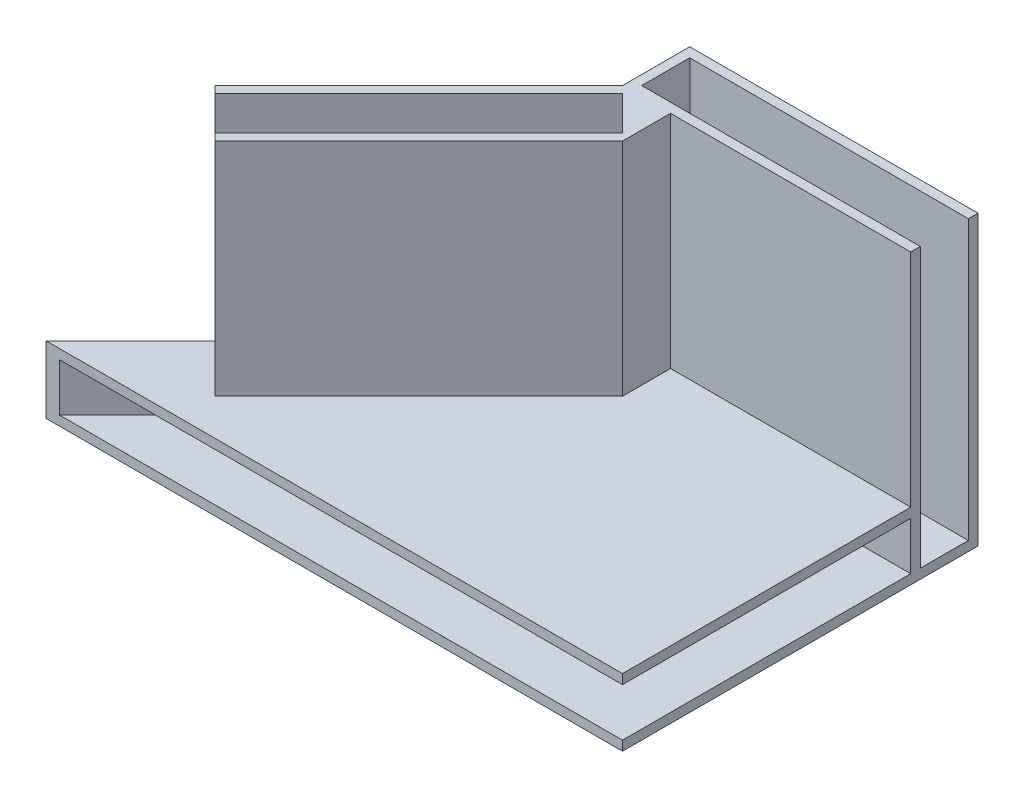
ISO-10303-21;
HEADER;
FILE_DESCRIPTION(('STEP AP214'),'2;1');
FILE_NAME('part.step','',(''),(''),'','','');
FILE_SCHEMA(('AUTOMOTIVE_DESIGN { 1 0 10303 214 1 1 1 1 }'));
ENDSEC;
DATA;
#1=APPLICATION_CONTEXT('core data for automotive mechanical design processes');
#2=APPLICATION_PROTOCOL_DEFINITION('international standard','automotive_design',2000,#1);
#3=PRODUCT_CONTEXT('',#1,'mechanical');
#4=PRODUCT('Part','Part','',(#3));
#5=PRODUCT_RELATED_PRODUCT_CATEGORY('part','',(#4));
#6=PRODUCT_DEFINITION_FORMATION('','',#4);
#7=PRODUCT_DEFINITION_CONTEXT('part definition',#1,'design');
#8=PRODUCT_DEFINITION('design','',#6,#7);
#9=PRODUCT_DEFINITION_SHAPE('','',#8);
#10=(LENGTH_UNIT() NAMED_UNIT(*) SI_UNIT(.MILLI.,.METRE.));
#11=(NAMED_UNIT(*) PLANE_ANGLE_UNIT() SI_UNIT($,.RADIAN.));
#12=(NAMED_UNIT(*) SI_UNIT($,.STERADIAN.) SOLID_ANGLE_UNIT());
#13=UNCERTAINTY_MEASURE_WITH_UNIT(LENGTH_MEASURE(1.E-05),#10,'distance_accuracy_value','');
#14=(GEOMETRIC_REPRESENTATION_CONTEXT(3) GLOBAL_UNCERTAINTY_ASSIGNED_CONTEXT((#13)) GLOBAL_UNIT_ASSIGNED_CONTEXT((#10,
#11,#12)) REPRESENTATION_CONTEXT('',''));
#15=CARTESIAN_POINT('',(0.,0.,0.));
#16=DIRECTION('',(0.,0.,1.));
#17=DIRECTION('',(1.,0.,0.));
#18=AXIS2_PLACEMENT_3D('',#15,#16,#17);
#19=CARTESIAN_POINT('',(0.,0.,7.));
#20=DIRECTION('',(0.,0.,-1.));
#21=DIRECTION('',(-1.,0.,0.));
#22=AXIS2_PLACEMENT_3D('',#19,#20,#21);
#23=PLANE('',#22);
#24=DIRECTION('',(1.,0.,0.));
#25=VECTOR('',#24,1.);
#26=CARTESIAN_POINT('',(0.,0.,7.));
#27=LINE('',#26,#25);
#28=CARTESIAN_POINT('',(5.,0.,7.));
#29=VERTEX_POINT('',#28);
#30=CARTESIAN_POINT('',(30.,0.,7.));
#31=VERTEX_POINT('',#30);
#32=EDGE_CURVE('E285',#29,#31,#27,.T.);
#33=ORIENTED_EDGE('',*,*,#32,.F.);
#34=DIRECTION('',(0.,1.,0.));
#35=VECTOR('',#34,1.);
#36=CARTESIAN_POINT('',(5.,0.,7.));
#37=LINE('',#36,#35);
#38=CARTESIAN_POINT('',(5.,-23.,7.));
#39=VERTEX_POINT('',#38);
#40=EDGE_CURVE('E218',#39,#29,#37,.T.);
#41=ORIENTED_EDGE('',*,*,#40,.F.);
#42=DIRECTION('',(1.,0.,0.));
#43=VECTOR('',#42,1.);
#44=CARTESIAN_POINT('',(0.,-23.,7.));
#45=LINE('',#44,#43);
#46=CARTESIAN_POINT('',(30.,-23.,7.));
#47=VERTEX_POINT('',#46);
#48=EDGE_CURVE('E283',#39,#47,#45,.T.);
#49=ORIENTED_EDGE('',*,*,#48,.T.);
#50=DIRECTION('',(0.,1.,0.));
#51=VECTOR('',#50,1.);
#52=CARTESIAN_POINT('',(30.,0.,7.));
#53=LINE('',#52,#51);
#54=EDGE_CURVE('E44',#47,#31,#53,.T.);
#55=ORIENTED_EDGE('',*,*,#54,.T.);
#56=EDGE_LOOP('',(#33,#41,#49,#55));
#57=FACE_BOUND('',#56,.T.);
#58=ADVANCED_FACE('F36',(#57),#23,.F.);
#59=CARTESIAN_POINT('',(0.,0.,7.));
#60=DIRECTION('',(1.,0.,0.));
#61=DIRECTION('',(0.,0.,-1.));
#62=AXIS2_PLACEMENT_3D('',#59,#60,#61);
#63=PLANE('',#62);
#64=DIRECTION('',(0.,0.,-1.));
#65=VECTOR('',#64,1.);
#66=CARTESIAN_POINT('',(0.,0.,7.));
#67=LINE('',#66,#65);
#68=CARTESIAN_POINT('',(0.,0.,7.));
#69=VERTEX_POINT('',#68);
#70=CARTESIAN_POINT('',(0.,0.,0.));
#71=VERTEX_POINT('',#70);
#72=EDGE_CURVE('E190',#69,#71,#67,.T.);
#73=ORIENTED_EDGE('',*,*,#72,.T.);
#74=DIRECTION('',(0.,-1.,0.));
#75=VECTOR('',#74,1.);
#76=CARTESIAN_POINT('',(0.,0.,0.));
#77=LINE('',#76,#75);
#78=CARTESIAN_POINT('',(0.,-30.,0.));
#79=VERTEX_POINT('',#78);
#80=EDGE_CURVE('E229',#71,#79,#77,.T.);
#81=ORIENTED_EDGE('',*,*,#80,.T.);
#82=DIRECTION('',(0.,0.,-1.));
#83=VECTOR('',#82,1.);
#84=CARTESIAN_POINT('',(0.,-30.,7.));
#85=LINE('',#84,#83);
#86=CARTESIAN_POINT('',(0.,-30.,7.));
#87=VERTEX_POINT('',#86);
#88=EDGE_CURVE('E211',#87,#79,#85,.T.);
#89=ORIENTED_EDGE('',*,*,#88,.F.);
#90=DIRECTION('',(0.,-1.,0.));
#91=VECTOR('',#90,1.);
#92=CARTESIAN_POINT('',(0.,23.,7.));
#93=LINE('',#92,#91);
#94=EDGE_CURVE('E204',#69,#87,#93,.T.);
#95=ORIENTED_EDGE('',*,*,#94,.F.);
#96=EDGE_LOOP('',(#73,#81,#89,#95));
#97=FACE_BOUND('',#96,.T.);
#98=ADVANCED_FACE('F38',(#97),#63,.F.);
#99=CARTESIAN_POINT('',(30.,0.,7.));
#100=DIRECTION('',(-1.,0.,0.));
#101=DIRECTION('',(0.,0.,1.));
#102=AXIS2_PLACEMENT_3D('',#99,#100,#101);
#103=PLANE('',#102);
#104=DIRECTION('',(0.,0.,1.));
#105=VECTOR('',#104,1.);
#106=CARTESIAN_POINT('',(30.,0.,0.));
#107=LINE('',#106,#105);
#108=CARTESIAN_POINT('',(30.,0.,6.));
#109=VERTEX_POINT('',#108);
#110=EDGE_CURVE('E393',#109,#31,#107,.T.);
#111=ORIENTED_EDGE('',*,*,#110,.T.);
#112=ORIENTED_EDGE('',*,*,#54,.F.);
#113=DIRECTION('',(0.,0.,-1.));
#114=VECTOR('',#113,1.);
#115=CARTESIAN_POINT('',(30.,-23.,37.));
#116=LINE('',#115,#114);
#117=CARTESIAN_POINT('',(30.,-23.,37.));
#118=VERTEX_POINT('',#117);
#119=EDGE_CURVE('E369',#118,#47,#116,.T.);
#120=ORIENTED_EDGE('',*,*,#119,.F.);
#121=DIRECTION('',(0.,-1.,0.));
#122=VECTOR('',#121,1.);
#123=CARTESIAN_POINT('',(30.,-30.,37.));
#124=LINE('',#123,#122);
#125=CARTESIAN_POINT('',(30.,-24.,37.));
#126=VERTEX_POINT('',#125);
#127=EDGE_CURVE('E364',#118,#126,#124,.T.);
#128=ORIENTED_EDGE('',*,*,#127,.T.);
#129=DIRECTION('',(0.,0.,-1.));
#130=VECTOR('',#129,1.);
#131=CARTESIAN_POINT('',(30.,-24.,36.));
#132=LINE('',#131,#130);
#133=CARTESIAN_POINT('',(30.,-24.,7.));
#134=VERTEX_POINT('',#133);
#135=EDGE_CURVE('E299',#126,#134,#132,.T.);
#136=ORIENTED_EDGE('',*,*,#135,.T.);
#137=DIRECTION('',(0.,-1.,0.));
#138=VECTOR('',#137,1.);
#139=CARTESIAN_POINT('',(30.,-24.,7.));
#140=LINE('',#139,#138);
#141=CARTESIAN_POINT('',(30.,-29.,7.));
#142=VERTEX_POINT('',#141);
#143=EDGE_CURVE('E301',#134,#142,#140,.T.);
#144=ORIENTED_EDGE('',*,*,#143,.T.);
#145=DIRECTION('',(0.,0.,1.));
#146=VECTOR('',#145,1.);
#147=CARTESIAN_POINT('',(30.,-29.,36.));
#148=LINE('',#147,#146);
#149=CARTESIAN_POINT('',(30.,-29.,37.));
#150=VERTEX_POINT('',#149);
#151=EDGE_CURVE('E304',#142,#150,#148,.T.);
#152=ORIENTED_EDGE('',*,*,#151,.T.);
#153=CARTESIAN_POINT('',(30.,-30.,37.));
#154=VERTEX_POINT('',#153);
#155=EDGE_CURVE('E363',#150,#154,#124,.T.);
#156=ORIENTED_EDGE('',*,*,#155,.T.);
#157=DIRECTION('',(0.,0.,-1.));
#158=VECTOR('',#157,1.);
#159=CARTESIAN_POINT('',(30.,-30.,7.));
#160=LINE('',#159,#158);
#161=CARTESIAN_POINT('',(30.,-30.,0.));
#162=VERTEX_POINT('',#161);
#163=EDGE_CURVE('E242',#154,#162,#160,.T.);
#164=ORIENTED_EDGE('',*,*,#163,.T.);
#165=DIRECTION('',(0.,1.,0.));
#166=VECTOR('',#165,1.);
#167=CARTESIAN_POINT('',(30.,0.,0.));
#168=LINE('',#167,#166);
#169=CARTESIAN_POINT('',(30.,0.,0.));
#170=VERTEX_POINT('',#169);
#171=EDGE_CURVE('E232',#162,#170,#168,.T.);
#172=ORIENTED_EDGE('',*,*,#171,.T.);
#173=CARTESIAN_POINT('',(30.,0.,1.));
#174=VERTEX_POINT('',#173);
#175=EDGE_CURVE('E239',#170,#174,#107,.T.);
#176=ORIENTED_EDGE('',*,*,#175,.T.);
#177=DIRECTION('',(0.,1.,0.));
#178=VECTOR('',#177,1.);
#179=CARTESIAN_POINT('',(30.,0.,1.));
#180=LINE('',#179,#178);
#181=CARTESIAN_POINT('',(30.,-29.,1.));
#182=VERTEX_POINT('',#181);
#183=EDGE_CURVE('E215',#182,#174,#180,.T.);
#184=ORIENTED_EDGE('',*,*,#183,.F.);
#185=DIRECTION('',(0.,0.,-1.));
#186=VECTOR('',#185,1.);
#187=CARTESIAN_POINT('',(30.,-29.,7.));
#188=LINE('',#187,#186);
#189=CARTESIAN_POINT('',(30.,-29.,6.));
#190=VERTEX_POINT('',#189);
#191=EDGE_CURVE('E251',#190,#182,#188,.T.);
#192=ORIENTED_EDGE('',*,*,#191,.F.);
#193=DIRECTION('',(0.,1.,0.));
#194=VECTOR('',#193,1.);
#195=CARTESIAN_POINT('',(30.,0.,6.));
#196=LINE('',#195,#194);
#197=EDGE_CURVE('E224',#190,#109,#196,.T.);
#198=ORIENTED_EDGE('',*,*,#197,.T.);
#199=EDGE_LOOP('',(#111,#112,#120,#128,#136,#144,#152,#156,#164,#172,#176,#184,#192,#198));
#200=FACE_BOUND('',#199,.T.);
#201=ADVANCED_FACE('F238',(#200),#103,.F.);
#202=CARTESIAN_POINT('',(0.,0.,0.));
#203=DIRECTION('',(0.,0.,-1.));
#204=DIRECTION('',(-1.,0.,0.));
#205=AXIS2_PLACEMENT_3D('',#202,#203,#204);
#206=PLANE('',#205);
#207=ORIENTED_EDGE('',*,*,#80,.F.);
#208=DIRECTION('',(1.,0.,0.));
#209=VECTOR('',#208,1.);
#210=CARTESIAN_POINT('',(0.,0.,0.));
#211=LINE('',#210,#209);
#212=EDGE_CURVE('E195',#71,#170,#211,.T.);
#213=ORIENTED_EDGE('',*,*,#212,.T.);
#214=ORIENTED_EDGE('',*,*,#171,.F.);
#215=DIRECTION('',(-1.,0.,0.));
#216=VECTOR('',#215,1.);
#217=CARTESIAN_POINT('',(0.,-30.,0.));
#218=LINE('',#217,#216);
#219=EDGE_CURVE('E247',#162,#79,#218,.T.);
#220=ORIENTED_EDGE('',*,*,#219,.T.);
#221=EDGE_LOOP('',(#207,#213,#214,#220));
#222=FACE_BOUND('',#221,.T.);
#223=ADVANCED_FACE('F246',(#222),#206,.T.);
#224=CARTESIAN_POINT('',(1.,0.,7.));
#225=DIRECTION('',(1.,0.,0.));
#226=DIRECTION('',(0.,0.,-1.));
#227=AXIS2_PLACEMENT_3D('',#224,#225,#226);
#228=PLANE('',#227);
#229=DIRECTION('',(0.,-1.,0.));
#230=VECTOR('',#229,1.);
#231=CARTESIAN_POINT('',(1.,0.,1.));
#232=LINE('',#231,#230);
#233=CARTESIAN_POINT('',(1.,0.,1.));
#234=VERTEX_POINT('',#233);
#235=CARTESIAN_POINT('',(1.,-29.,1.));
#236=VERTEX_POINT('',#235);
#237=EDGE_CURVE('E212',#234,#236,#232,.T.);
#238=ORIENTED_EDGE('',*,*,#237,.F.);
#239=DIRECTION('',(0.,0.,1.));
#240=VECTOR('',#239,1.);
#241=CARTESIAN_POINT('',(1.,0.,7.));
#242=LINE('',#241,#240);
#243=CARTESIAN_POINT('',(1.,0.,6.));
#244=VERTEX_POINT('',#243);
#245=EDGE_CURVE('E288',#234,#244,#242,.T.);
#246=ORIENTED_EDGE('',*,*,#245,.T.);
#247=DIRECTION('',(0.,-1.,0.));
#248=VECTOR('',#247,1.);
#249=CARTESIAN_POINT('',(1.,0.,6.));
#250=LINE('',#249,#248);
#251=CARTESIAN_POINT('',(1.,-29.,6.));
#252=VERTEX_POINT('',#251);
#253=EDGE_CURVE('E222',#244,#252,#250,.T.);
#254=ORIENTED_EDGE('',*,*,#253,.T.);
#255=DIRECTION('',(0.,0.,-1.));
#256=VECTOR('',#255,1.);
#257=CARTESIAN_POINT('',(1.,-29.,7.));
#258=LINE('',#257,#256);
#259=EDGE_CURVE('E255',#252,#236,#258,.T.);
#260=ORIENTED_EDGE('',*,*,#259,.T.);
#261=EDGE_LOOP('',(#238,#246,#254,#260));
#262=FACE_BOUND('',#261,.T.);
#263=ADVANCED_FACE('F389',(#262),#228,.T.);
#264=CARTESIAN_POINT('',(0.,0.,6.));
#265=DIRECTION('',(0.,0.,-1.));
#266=DIRECTION('',(-1.,0.,0.));
#267=AXIS2_PLACEMENT_3D('',#264,#265,#266);
#268=PLANE('',#267);
#269=ORIENTED_EDGE('',*,*,#253,.F.);
#270=DIRECTION('',(1.,0.,0.));
#271=VECTOR('',#270,1.);
#272=CARTESIAN_POINT('',(0.,0.,6.));
#273=LINE('',#272,#271);
#274=EDGE_CURVE('E296',#244,#109,#273,.T.);
#275=ORIENTED_EDGE('',*,*,#274,.T.);
#276=ORIENTED_EDGE('',*,*,#197,.F.);
#277=DIRECTION('',(-1.,0.,0.));
#278=VECTOR('',#277,1.);
#279=CARTESIAN_POINT('',(0.,-29.,6.));
#280=LINE('',#279,#278);
#281=EDGE_CURVE('E375',#190,#252,#280,.T.);
#282=ORIENTED_EDGE('',*,*,#281,.T.);
#283=EDGE_LOOP('',(#269,#275,#276,#282));
#284=FACE_BOUND('',#283,.T.);
#285=ADVANCED_FACE('F382',(#284),#268,.T.);
#286=CARTESIAN_POINT('',(0.,0.,1.));
#287=DIRECTION('',(0.,0.,-1.));
#288=DIRECTION('',(-1.,0.,0.));
#289=AXIS2_PLACEMENT_3D('',#286,#287,#288);
#290=PLANE('',#289);
#291=DIRECTION('',(1.,0.,0.));
#292=VECTOR('',#291,1.);
#293=CARTESIAN_POINT('',(0.,0.,1.));
#294=LINE('',#293,#292);
#295=EDGE_CURVE('E286',#234,#174,#294,.T.);
#296=ORIENTED_EDGE('',*,*,#295,.F.);
#297=ORIENTED_EDGE('',*,*,#237,.T.);
#298=DIRECTION('',(-1.,0.,0.));
#299=VECTOR('',#298,1.);
#300=CARTESIAN_POINT('',(0.,-29.,1.));
#301=LINE('',#300,#299);
#302=EDGE_CURVE('E372',#182,#236,#301,.T.);
#303=ORIENTED_EDGE('',*,*,#302,.F.);
#304=ORIENTED_EDGE('',*,*,#183,.T.);
#305=EDGE_LOOP('',(#296,#297,#303,#304));
#306=FACE_BOUND('',#305,.T.);
#307=ADVANCED_FACE('F392',(#306),#290,.F.);
#308=CARTESIAN_POINT('',(5.,0.,12.));
#309=DIRECTION('',(-1.,0.,0.));
#310=DIRECTION('',(0.,0.,1.));
#311=AXIS2_PLACEMENT_3D('',#308,#309,#310);
#312=PLANE('',#311);
#313=DIRECTION('',(0.,0.,-1.));
#314=VECTOR('',#313,1.);
#315=CARTESIAN_POINT('',(5.,0.,12.));
#316=LINE('',#315,#314);
#317=CARTESIAN_POINT('',(4.99999999999999,0.,12.));
#318=VERTEX_POINT('',#317);
#319=EDGE_CURVE('E276',#318,#29,#316,.T.);
#320=ORIENTED_EDGE('',*,*,#319,.F.);
#321=DIRECTION('',(0.,1.,0.));
#322=VECTOR('',#321,1.);
#323=CARTESIAN_POINT('',(5.,0.,12.));
#324=LINE('',#323,#322);
#325=CARTESIAN_POINT('',(5.,-23.,12.));
#326=VERTEX_POINT('',#325);
#327=EDGE_CURVE('E213',#326,#318,#324,.T.);
#328=ORIENTED_EDGE('',*,*,#327,.F.);
#329=DIRECTION('',(0.,0.,-1.));
#330=VECTOR('',#329,1.);
#331=CARTESIAN_POINT('',(5.,-23.,12.));
#332=LINE('',#331,#330);
#333=EDGE_CURVE('E278',#326,#39,#332,.T.);
#334=ORIENTED_EDGE('',*,*,#333,.T.);
#335=ORIENTED_EDGE('',*,*,#40,.T.);
#336=EDGE_LOOP('',(#320,#328,#334,#335));
#337=FACE_BOUND('',#336,.T.);
#338=ADVANCED_FACE('F275',(#337),#312,.F.);
#339=CARTESIAN_POINT('',(-21.2132034355964,23.,28.2132034355964));
#340=DIRECTION('',(0.707106781186547,0.,0.707106781186548));
#341=DIRECTION('',(0.707106781186548,0.,-0.707106781186547));
#342=AXIS2_PLACEMENT_3D('',#339,#340,#341);
#343=PLANE('',#342);
#344=DIRECTION('',(0.707106781186547,0.,-0.707106781186547));
#345=VECTOR('',#344,1.);
#346=CARTESIAN_POINT('',(-30.,0.,37.));
#347=LINE('',#346,#345);
#348=CARTESIAN_POINT('',(-21.2132034355964,0.,28.2132034355964));
#349=VERTEX_POINT('',#348);
#350=EDGE_CURVE('E193',#349,#69,#347,.T.);
#351=ORIENTED_EDGE('',*,*,#350,.T.);
#352=ORIENTED_EDGE('',*,*,#94,.T.);
#353=DIRECTION('',(-0.707106781186548,0.,0.707106781186548));
#354=VECTOR('',#353,1.);
#355=CARTESIAN_POINT('',(0.,-30.,7.));
#356=LINE('',#355,#354);
#357=CARTESIAN_POINT('',(-30.,-30.,37.));
#358=VERTEX_POINT('',#357);
#359=EDGE_CURVE('E339',#87,#358,#356,.T.);
#360=ORIENTED_EDGE('',*,*,#359,.T.);
#361=DIRECTION('',(0.,-1.,0.));
#362=VECTOR('',#361,1.);
#363=CARTESIAN_POINT('',(-30.,-23.,37.));
#364=LINE('',#363,#362);
#365=CARTESIAN_POINT('',(-30.,-23.,37.));
#366=VERTEX_POINT('',#365);
#367=EDGE_CURVE('E358',#366,#358,#364,.T.);
#368=ORIENTED_EDGE('',*,*,#367,.F.);
#369=DIRECTION('',(-0.707106781186547,0.,0.707106781186547));
#370=VECTOR('',#369,1.);
#371=CARTESIAN_POINT('',(-30.,-23.,37.));
#372=LINE('',#371,#370);
#373=CARTESIAN_POINT('',(-21.2132034355964,-23.,28.2132034355964));
#374=VERTEX_POINT('',#373);
#375=EDGE_CURVE('E336',#374,#366,#372,.T.);
#376=ORIENTED_EDGE('',*,*,#375,.F.);
#377=DIRECTION('',(0.,-1.,0.));
#378=VECTOR('',#377,1.);
#379=CARTESIAN_POINT('',(-21.2132034355964,23.,28.2132034355964));
#380=LINE('',#379,#378);
#381=EDGE_CURVE('E207',#349,#374,#380,.T.);
#382=ORIENTED_EDGE('',*,*,#381,.F.);
#383=EDGE_LOOP('',(#351,#352,#360,#368,#376,#382));
#384=FACE_BOUND('',#383,.T.);
#385=ADVANCED_FACE('F202',(#384),#343,.F.);
#386=CARTESIAN_POINT('',(-16.2132034355964,0.,33.2132034355964));
#387=DIRECTION('',(-0.707106781186547,0.,-0.707106781186548));
#388=DIRECTION('',(-0.707106781186548,0.,0.707106781186547));
#389=AXIS2_PLACEMENT_3D('',#386,#387,#388);
#390=PLANE('',#389);
#391=DIRECTION('',(0.707106781186548,0.,-0.707106781186547));
#392=VECTOR('',#391,1.);
#393=CARTESIAN_POINT('',(-16.2132034355964,0.,33.2132034355964));
#394=LINE('',#393,#392);
#395=CARTESIAN_POINT('',(-16.2132034355964,0.,33.2132034355964));
#396=VERTEX_POINT('',#395);
#397=EDGE_CURVE('E290',#396,#318,#394,.T.);
#398=ORIENTED_EDGE('',*,*,#397,.F.);
#399=DIRECTION('',(0.,1.,0.));
#400=VECTOR('',#399,1.);
#401=CARTESIAN_POINT('',(-16.2132034355964,0.,33.2132034355964));
#402=LINE('',#401,#400);
#403=CARTESIAN_POINT('',(-16.2132034355964,-23.,33.2132034355964));
#404=VERTEX_POINT('',#403);
#405=EDGE_CURVE('E268',#404,#396,#402,.T.);
#406=ORIENTED_EDGE('',*,*,#405,.F.);
#407=DIRECTION('',(0.707106781186548,0.,-0.707106781186547));
#408=VECTOR('',#407,1.);
#409=CARTESIAN_POINT('',(-16.2132034355964,-23.,33.2132034355964));
#410=LINE('',#409,#408);
#411=EDGE_CURVE('E354',#404,#326,#410,.T.);
#412=ORIENTED_EDGE('',*,*,#411,.T.);
#413=ORIENTED_EDGE('',*,*,#327,.T.);
#414=EDGE_LOOP('',(#398,#406,#412,#413));
#415=FACE_BOUND('',#414,.T.);
#416=ADVANCED_FACE('F448',(#415),#390,.F.);
#417=CARTESIAN_POINT('',(-24.7132034355964,0.,24.7132034355964));
#418=DIRECTION('',(-0.707106781186548,0.,0.707106781186547));
#419=DIRECTION('',(0.707106781186547,0.,0.707106781186548));
#420=AXIS2_PLACEMENT_3D('',#417,#418,#419);
#421=PLANE('',#420);
#422=ORIENTED_EDGE('',*,*,#405,.T.);
#423=DIRECTION('',(-0.707106781186547,0.,-0.707106781186548));
#424=VECTOR('',#423,1.);
#425=CARTESIAN_POINT('',(-24.7132034355964,0.,24.7132034355964));
#426=LINE('',#425,#424);
#427=CARTESIAN_POINT('',(-16.920310216783,0.,32.5060966544099));
#428=VERTEX_POINT('',#427);
#429=EDGE_CURVE('E402',#396,#428,#426,.T.);
#430=ORIENTED_EDGE('',*,*,#429,.T.);
#431=DIRECTION('',(0.,-1.,0.));
#432=VECTOR('',#431,1.);
#433=CARTESIAN_POINT('',(-16.920310216783,22.,32.5060966544099));
#434=LINE('',#433,#432);
#435=CARTESIAN_POINT('',(-16.920310216783,-22.,32.5060966544099));
#436=VERTEX_POINT('',#435);
#437=EDGE_CURVE('E58',#428,#436,#434,.T.);
#438=ORIENTED_EDGE('',*,*,#437,.T.);
#439=DIRECTION('',(-0.707106781186548,0.,-0.707106781186547));
#440=VECTOR('',#439,1.);
#441=CARTESIAN_POINT('',(-16.920310216783,-22.,32.5060966544099));
#442=LINE('',#441,#440);
#443=CARTESIAN_POINT('',(-20.5060966544099,-22.,28.920310216783));
#444=VERTEX_POINT('',#443);
#445=EDGE_CURVE('E341',#436,#444,#442,.T.);
#446=ORIENTED_EDGE('',*,*,#445,.T.);
#447=DIRECTION('',(0.,-1.,0.));
#448=VECTOR('',#447,1.);
#449=CARTESIAN_POINT('',(-20.5060966544099,22.,28.920310216783));
#450=LINE('',#449,#448);
#451=CARTESIAN_POINT('',(-20.5060966544099,0.,28.920310216783));
#452=VERTEX_POINT('',#451);
#453=EDGE_CURVE('E260',#452,#444,#450,.T.);
#454=ORIENTED_EDGE('',*,*,#453,.F.);
#455=EDGE_CURVE('E50',#452,#349,#426,.T.);
#456=ORIENTED_EDGE('',*,*,#455,.T.);
#457=ORIENTED_EDGE('',*,*,#381,.T.);
#458=DIRECTION('',(-0.707106781186547,0.,-0.707106781186548));
#459=VECTOR('',#458,1.);
#460=CARTESIAN_POINT('',(-16.2132034355964,-23.,33.2132034355964));
#461=LINE('',#460,#459);
#462=EDGE_CURVE('E351',#404,#374,#461,.T.);
#463=ORIENTED_EDGE('',*,*,#462,.F.);
#464=EDGE_LOOP('',(#422,#430,#438,#446,#454,#456,#457,#463));
#465=FACE_BOUND('',#464,.T.);
#466=ADVANCED_FACE('F404',(#465),#421,.T.);
#467=CARTESIAN_POINT('',(-16.2132034355964,22.,31.7989898732233));
#468=DIRECTION('',(0.707106781186549,0.,0.707106781186546));
#469=DIRECTION('',(0.707106781186546,0.,-0.707106781186549));
#470=AXIS2_PLACEMENT_3D('',#467,#468,#469);
#471=PLANE('',#470);
#472=DIRECTION('',(-0.707106781186546,0.,0.707106781186549));
#473=VECTOR('',#472,1.);
#474=CARTESIAN_POINT('',(-16.2132034355964,0.,31.7989898732233));
#475=LINE('',#474,#473);
#476=CARTESIAN_POINT('',(4.29289321881345,0.,11.2928932188134));
#477=VERTEX_POINT('',#476);
#478=EDGE_CURVE('E400',#477,#428,#475,.T.);
#479=ORIENTED_EDGE('',*,*,#478,.F.);
#480=DIRECTION('',(0.,-1.,0.));
#481=VECTOR('',#480,1.);
#482=CARTESIAN_POINT('',(4.29289321881345,22.,11.2928932188134));
#483=LINE('',#482,#481);
#484=CARTESIAN_POINT('',(4.29289321881345,-22.,11.2928932188134));
#485=VERTEX_POINT('',#484);
#486=EDGE_CURVE('E262',#477,#485,#483,.T.);
#487=ORIENTED_EDGE('',*,*,#486,.T.);
#488=DIRECTION('',(-0.707106781186548,0.,0.707106781186548));
#489=VECTOR('',#488,1.);
#490=CARTESIAN_POINT('',(-16.2132034355964,-22.,31.7989898732233));
#491=LINE('',#490,#489);
#492=EDGE_CURVE('E349',#485,#436,#491,.T.);
#493=ORIENTED_EDGE('',*,*,#492,.T.);
#494=ORIENTED_EDGE('',*,*,#437,.F.);
#495=EDGE_LOOP('',(#479,#487,#493,#494));
#496=FACE_BOUND('',#495,.T.);
#497=ADVANCED_FACE('F407',(#496),#471,.F.);
#498=CARTESIAN_POINT('',(4.29289321881345,22.,11.2928932188134));
#499=DIRECTION('',(0.707106781186548,0.,-0.707106781186548));
#500=DIRECTION('',(-0.707106781186548,0.,-0.707106781186548));
#501=AXIS2_PLACEMENT_3D('',#498,#499,#500);
#502=PLANE('',#501);
#503=DIRECTION('',(0.707106781186548,0.,0.707106781186548));
#504=VECTOR('',#503,1.);
#505=CARTESIAN_POINT('',(4.29289321881345,0.,11.2928932188134));
#506=LINE('',#505,#504);
#507=CARTESIAN_POINT('',(0.707106781186542,0.,7.70710678118655));
#508=VERTEX_POINT('',#507);
#509=EDGE_CURVE('E396',#508,#477,#506,.T.);
#510=ORIENTED_EDGE('',*,*,#509,.F.);
#511=DIRECTION('',(0.,-1.,0.));
#512=VECTOR('',#511,1.);
#513=CARTESIAN_POINT('',(0.707106781186545,22.,7.70710678118655));
#514=LINE('',#513,#512);
#515=CARTESIAN_POINT('',(0.707106781186545,-22.,7.70710678118655));
#516=VERTEX_POINT('',#515);
#517=EDGE_CURVE('E264',#508,#516,#514,.T.);
#518=ORIENTED_EDGE('',*,*,#517,.T.);
#519=DIRECTION('',(0.707106781186547,0.,0.707106781186547));
#520=VECTOR('',#519,1.);
#521=CARTESIAN_POINT('',(4.29289321881345,-22.,11.2928932188134));
#522=LINE('',#521,#520);
#523=EDGE_CURVE('E346',#516,#485,#522,.T.);
#524=ORIENTED_EDGE('',*,*,#523,.T.);
#525=ORIENTED_EDGE('',*,*,#486,.F.);
#526=EDGE_LOOP('',(#510,#518,#524,#525));
#527=FACE_BOUND('',#526,.T.);
#528=ADVANCED_FACE('F421',(#527),#502,.F.);
#529=CARTESIAN_POINT('',(-19.7989898732233,22.,28.2132034355964));
#530=DIRECTION('',(-0.707106781186548,0.,-0.707106781186548));
#531=DIRECTION('',(-0.707106781186548,0.,0.707106781186548));
#532=AXIS2_PLACEMENT_3D('',#529,#530,#531);
#533=PLANE('',#532);
#534=DIRECTION('',(0.707106781186548,0.,-0.707106781186548));
#535=VECTOR('',#534,1.);
#536=CARTESIAN_POINT('',(-19.7989898732233,0.,28.2132034355964));
#537=LINE('',#536,#535);
#538=EDGE_CURVE('E11',#452,#508,#537,.T.);
#539=ORIENTED_EDGE('',*,*,#538,.F.);
#540=ORIENTED_EDGE('',*,*,#453,.T.);
#541=DIRECTION('',(0.707106781186547,0.,-0.707106781186547));
#542=VECTOR('',#541,1.);
#543=CARTESIAN_POINT('',(-19.7989898732233,-22.,28.2132034355964));
#544=LINE('',#543,#542);
#545=EDGE_CURVE('E343',#444,#516,#544,.T.);
#546=ORIENTED_EDGE('',*,*,#545,.T.);
#547=ORIENTED_EDGE('',*,*,#517,.F.);
#548=EDGE_LOOP('',(#539,#540,#546,#547));
#549=FACE_BOUND('',#548,.T.);
#550=ADVANCED_FACE('F417',(#549),#533,.F.);
#551=CARTESIAN_POINT('',(0.,0.,7.));
#552=DIRECTION('',(0.,0.,-1.));
#553=DIRECTION('',(-1.,0.,0.));
#554=AXIS2_PLACEMENT_3D('',#551,#552,#553);
#555=PLANE('',#554);
#556=DIRECTION('',(0.,1.,0.));
#557=VECTOR('',#556,1.);
#558=CARTESIAN_POINT('',(1.,0.,7.));
#559=LINE('',#558,#557);
#560=CARTESIAN_POINT('',(1.,-29.,7.));
#561=VERTEX_POINT('',#560);
#562=CARTESIAN_POINT('',(1.,-24.,7.));
#563=VERTEX_POINT('',#562);
#564=EDGE_CURVE('E333',#561,#563,#559,.T.);
#565=ORIENTED_EDGE('',*,*,#564,.F.);
#566=DIRECTION('',(1.,0.,0.));
#567=VECTOR('',#566,1.);
#568=CARTESIAN_POINT('',(0.,-29.,7.));
#569=LINE('',#568,#567);
#570=EDGE_CURVE('E319',#561,#142,#569,.T.);
#571=ORIENTED_EDGE('',*,*,#570,.T.);
#572=ORIENTED_EDGE('',*,*,#143,.F.);
#573=DIRECTION('',(1.,0.,0.));
#574=VECTOR('',#573,1.);
#575=CARTESIAN_POINT('',(0.,-24.,7.));
#576=LINE('',#575,#574);
#577=EDGE_CURVE('E330',#563,#134,#576,.T.);
#578=ORIENTED_EDGE('',*,*,#577,.F.);
#579=EDGE_LOOP('',(#565,#571,#572,#578));
#580=FACE_BOUND('',#579,.T.);
#581=ADVANCED_FACE('F428',(#580),#555,.F.);
#582=CARTESIAN_POINT('',(0.,-23.,37.));
#583=DIRECTION('',(0.,-1.,0.));
#584=DIRECTION('',(0.,0.,1.));
#585=AXIS2_PLACEMENT_3D('',#582,#583,#584);
#586=PLANE('',#585);
#587=DIRECTION('',(1.,0.,0.));
#588=VECTOR('',#587,1.);
#589=CARTESIAN_POINT('',(0.,-23.,37.));
#590=LINE('',#589,#588);
#591=EDGE_CURVE('E360',#366,#118,#590,.T.);
#592=ORIENTED_EDGE('',*,*,#591,.T.);
#593=ORIENTED_EDGE('',*,*,#119,.T.);
#594=ORIENTED_EDGE('',*,*,#48,.F.);
#595=ORIENTED_EDGE('',*,*,#333,.F.);
#596=ORIENTED_EDGE('',*,*,#411,.F.);
#597=ORIENTED_EDGE('',*,*,#462,.T.);
#598=ORIENTED_EDGE('',*,*,#375,.T.);
#599=EDGE_LOOP('',(#592,#593,#594,#595,#596,#597,#598));
#600=FACE_BOUND('',#599,.T.);
#601=ADVANCED_FACE('F552',(#600),#586,.F.);
#602=CARTESIAN_POINT('',(0.,-30.,7.));
#603=DIRECTION('',(0.,1.,0.));
#604=DIRECTION('',(0.,0.,-1.));
#605=AXIS2_PLACEMENT_3D('',#602,#603,#604);
#606=PLANE('',#605);
#607=ORIENTED_EDGE('',*,*,#88,.T.);
#608=ORIENTED_EDGE('',*,*,#219,.F.);
#609=ORIENTED_EDGE('',*,*,#163,.F.);
#610=DIRECTION('',(-1.,0.,0.));
#611=VECTOR('',#610,1.);
#612=CARTESIAN_POINT('',(0.,-30.,37.));
#613=LINE('',#612,#611);
#614=EDGE_CURVE('E367',#154,#358,#613,.T.);
#615=ORIENTED_EDGE('',*,*,#614,.T.);
#616=ORIENTED_EDGE('',*,*,#359,.F.);
#617=EDGE_LOOP('',(#607,#608,#609,#615,#616));
#618=FACE_BOUND('',#617,.T.);
#619=ADVANCED_FACE('F249',(#618),#606,.F.);
#620=CARTESIAN_POINT('',(0.,-29.,7.));
#621=DIRECTION('',(0.,1.,0.));
#622=DIRECTION('',(0.,0.,-1.));
#623=AXIS2_PLACEMENT_3D('',#620,#621,#622);
#624=PLANE('',#623);
#625=ORIENTED_EDGE('',*,*,#302,.T.);
#626=ORIENTED_EDGE('',*,*,#259,.F.);
#627=ORIENTED_EDGE('',*,*,#281,.F.);
#628=ORIENTED_EDGE('',*,*,#191,.T.);
#629=EDGE_LOOP('',(#625,#626,#627,#628));
#630=FACE_BOUND('',#629,.T.);
#631=ADVANCED_FACE('F385',(#630),#624,.T.);
#632=CARTESIAN_POINT('',(0.,0.,37.));
#633=DIRECTION('',(0.,0.,1.));
#634=DIRECTION('',(1.,0.,0.));
#635=AXIS2_PLACEMENT_3D('',#632,#633,#634);
#636=PLANE('',#635);
#637=DIRECTION('',(-1.,0.,0.));
#638=VECTOR('',#637,1.);
#639=CARTESIAN_POINT('',(0.,-29.,37.));
#640=LINE('',#639,#638);
#641=CARTESIAN_POINT('',(-28.5857864376269,-29.,37.));
#642=VERTEX_POINT('',#641);
#643=EDGE_CURVE('E320',#150,#642,#640,.T.);
#644=ORIENTED_EDGE('',*,*,#643,.T.);
#645=DIRECTION('',(0.,-1.,0.));
#646=VECTOR('',#645,1.);
#647=CARTESIAN_POINT('',(-28.5857864376269,0.,37.));
#648=LINE('',#647,#646);
#649=CARTESIAN_POINT('',(-28.5857864376269,-24.,37.));
#650=VERTEX_POINT('',#649);
#651=EDGE_CURVE('E316',#650,#642,#648,.T.);
#652=ORIENTED_EDGE('',*,*,#651,.F.);
#653=DIRECTION('',(1.,0.,0.));
#654=VECTOR('',#653,1.);
#655=CARTESIAN_POINT('',(0.,-24.,37.));
#656=LINE('',#655,#654);
#657=EDGE_CURVE('E322',#650,#126,#656,.T.);
#658=ORIENTED_EDGE('',*,*,#657,.T.);
#659=ORIENTED_EDGE('',*,*,#127,.F.);
#660=ORIENTED_EDGE('',*,*,#591,.F.);
#661=ORIENTED_EDGE('',*,*,#367,.T.);
#662=ORIENTED_EDGE('',*,*,#614,.F.);
#663=ORIENTED_EDGE('',*,*,#155,.F.);
#664=EDGE_LOOP('',(#644,#652,#658,#659,#660,#661,#662,#663));
#665=FACE_BOUND('',#664,.T.);
#666=ADVANCED_FACE('F527',(#665),#636,.T.);
#667=CARTESIAN_POINT('',(0.,-22.,0.));
#668=DIRECTION('',(0.,-1.,0.));
#669=DIRECTION('',(0.,0.,1.));
#670=AXIS2_PLACEMENT_3D('',#667,#668,#669);
#671=PLANE('',#670);
#672=ORIENTED_EDGE('',*,*,#445,.F.);
#673=ORIENTED_EDGE('',*,*,#492,.F.);
#674=ORIENTED_EDGE('',*,*,#523,.F.);
#675=ORIENTED_EDGE('',*,*,#545,.F.);
#676=EDGE_LOOP('',(#672,#673,#674,#675));
#677=FACE_BOUND('',#676,.T.);
#678=ADVANCED_FACE('F414',(#677),#671,.F.);
#679=CARTESIAN_POINT('',(1.,0.,7.));
#680=DIRECTION('',(1.,0.,0.));
#681=DIRECTION('',(0.,0.,-1.));
#682=AXIS2_PLACEMENT_3D('',#679,#680,#681);
#683=PLANE('',#682);
#684=DIRECTION('',(0.,0.,1.));
#685=VECTOR('',#684,1.);
#686=CARTESIAN_POINT('',(1.,-24.,7.));
#687=LINE('',#686,#685);
#688=CARTESIAN_POINT('',(1.,-24.,7.4142135623731));
#689=VERTEX_POINT('',#688);
#690=EDGE_CURVE('E307',#563,#689,#687,.T.);
#691=ORIENTED_EDGE('',*,*,#690,.T.);
#692=DIRECTION('',(0.,1.,0.));
#693=VECTOR('',#692,1.);
#694=CARTESIAN_POINT('',(1.,0.,7.4142135623731));
#695=LINE('',#694,#693);
#696=CARTESIAN_POINT('',(1.,-29.,7.4142135623731));
#697=VERTEX_POINT('',#696);
#698=EDGE_CURVE('E313',#697,#689,#695,.T.);
#699=ORIENTED_EDGE('',*,*,#698,.F.);
#700=DIRECTION('',(0.,0.,-1.));
#701=VECTOR('',#700,1.);
#702=CARTESIAN_POINT('',(1.,-29.,7.));
#703=LINE('',#702,#701);
#704=EDGE_CURVE('E317',#697,#561,#703,.T.);
#705=ORIENTED_EDGE('',*,*,#704,.T.);
#706=ORIENTED_EDGE('',*,*,#564,.T.);
#707=EDGE_LOOP('',(#691,#699,#705,#706));
#708=FACE_BOUND('',#707,.T.);
#709=ADVANCED_FACE('F507',(#708),#683,.T.);
#710=CARTESIAN_POINT('',(0.,-24.,37.));
#711=DIRECTION('',(0.,-1.,0.));
#712=DIRECTION('',(0.,0.,1.));
#713=AXIS2_PLACEMENT_3D('',#710,#711,#712);
#714=PLANE('',#713);
#715=ORIENTED_EDGE('',*,*,#577,.T.);
#716=ORIENTED_EDGE('',*,*,#135,.F.);
#717=ORIENTED_EDGE('',*,*,#657,.F.);
#718=DIRECTION('',(-0.707106781186548,0.,0.707106781186547));
#719=VECTOR('',#718,1.);
#720=CARTESIAN_POINT('',(-20.5060966544099,-24.,28.920310216783));
#721=LINE('',#720,#719);
#722=EDGE_CURVE('E310',#689,#650,#721,.T.);
#723=ORIENTED_EDGE('',*,*,#722,.F.);
#724=ORIENTED_EDGE('',*,*,#690,.F.);
#725=EDGE_LOOP('',(#715,#716,#717,#723,#724));
#726=FACE_BOUND('',#725,.T.);
#727=ADVANCED_FACE('F496',(#726),#714,.T.);
#728=CARTESIAN_POINT('',(0.,-29.,7.));
#729=DIRECTION('',(0.,1.,0.));
#730=DIRECTION('',(0.,0.,-1.));
#731=AXIS2_PLACEMENT_3D('',#728,#729,#730);
#732=PLANE('',#731);
#733=ORIENTED_EDGE('',*,*,#570,.F.);
#734=ORIENTED_EDGE('',*,*,#704,.F.);
#735=DIRECTION('',(-0.707106781186548,0.,0.707106781186547));
#736=VECTOR('',#735,1.);
#737=CARTESIAN_POINT('',(0.707106781186549,-29.,7.70710678118655));
#738=LINE('',#737,#736);
#739=EDGE_CURVE('E312',#697,#642,#738,.T.);
#740=ORIENTED_EDGE('',*,*,#739,.T.);
#741=ORIENTED_EDGE('',*,*,#643,.F.);
#742=ORIENTED_EDGE('',*,*,#151,.F.);
#743=EDGE_LOOP('',(#733,#734,#740,#741,#742));
#744=FACE_BOUND('',#743,.T.);
#745=ADVANCED_FACE('F485',(#744),#732,.T.);
#746=CARTESIAN_POINT('',(-20.5060966544099,-23.,28.920310216783));
#747=DIRECTION('',(0.707106781186547,0.,0.707106781186548));
#748=DIRECTION('',(0.707106781186548,0.,-0.707106781186547));
#749=AXIS2_PLACEMENT_3D('',#746,#747,#748);
#750=PLANE('',#749);
#751=ORIENTED_EDGE('',*,*,#722,.T.);
#752=ORIENTED_EDGE('',*,*,#651,.T.);
#753=ORIENTED_EDGE('',*,*,#739,.F.);
#754=ORIENTED_EDGE('',*,*,#698,.T.);
#755=EDGE_LOOP('',(#751,#752,#753,#754));
#756=FACE_BOUND('',#755,.T.);
#757=ADVANCED_FACE('F481',(#756),#750,.T.);
#758=CARTESIAN_POINT('',(0.,0.,0.));
#759=DIRECTION('',(0.,1.,0.));
#760=DIRECTION('',(0.,0.,1.));
#761=AXIS2_PLACEMENT_3D('',#758,#759,#760);
#762=PLANE('',#761);
#763=ORIENTED_EDGE('',*,*,#245,.F.);
#764=ORIENTED_EDGE('',*,*,#295,.T.);
#765=ORIENTED_EDGE('',*,*,#175,.F.);
#766=ORIENTED_EDGE('',*,*,#212,.F.);
#767=ORIENTED_EDGE('',*,*,#72,.F.);
#768=ORIENTED_EDGE('',*,*,#350,.F.);
#769=ORIENTED_EDGE('',*,*,#455,.F.);
#770=ORIENTED_EDGE('',*,*,#538,.T.);
#771=ORIENTED_EDGE('',*,*,#509,.T.);
#772=ORIENTED_EDGE('',*,*,#478,.T.);
#773=ORIENTED_EDGE('',*,*,#429,.F.);
#774=ORIENTED_EDGE('',*,*,#397,.T.);
#775=ORIENTED_EDGE('',*,*,#319,.T.);
#776=ORIENTED_EDGE('',*,*,#32,.T.);
#777=ORIENTED_EDGE('',*,*,#110,.F.);
#778=ORIENTED_EDGE('',*,*,#274,.F.);
#779=EDGE_LOOP('',(#763,#764,#765,#766,#767,#768,#769,#770,#771,#772,#773,#774,#775,#776,#777,#778));
#780=FACE_BOUND('',#779,.T.);
#781=ADVANCED_FACE('F192',(#780),#762,.T.);
#782=CLOSED_SHELL('',(#58,#98,#201,#223,#263,#285,#307,#338,#385,#416,#466,#497,#528,#550,#581,
#601,#619,#631,#666,#678,#709,#727,#745,#757,#781));
#783=MANIFOLD_SOLID_BREP('B2',#782);
#784=ADVANCED_BREP_SHAPE_REPRESENTATION('',(#18,#783),#14);
#785=SHAPE_DEFINITION_REPRESENTATION(#9,#784);
ENDSEC;
END-ISO-10303-21;
